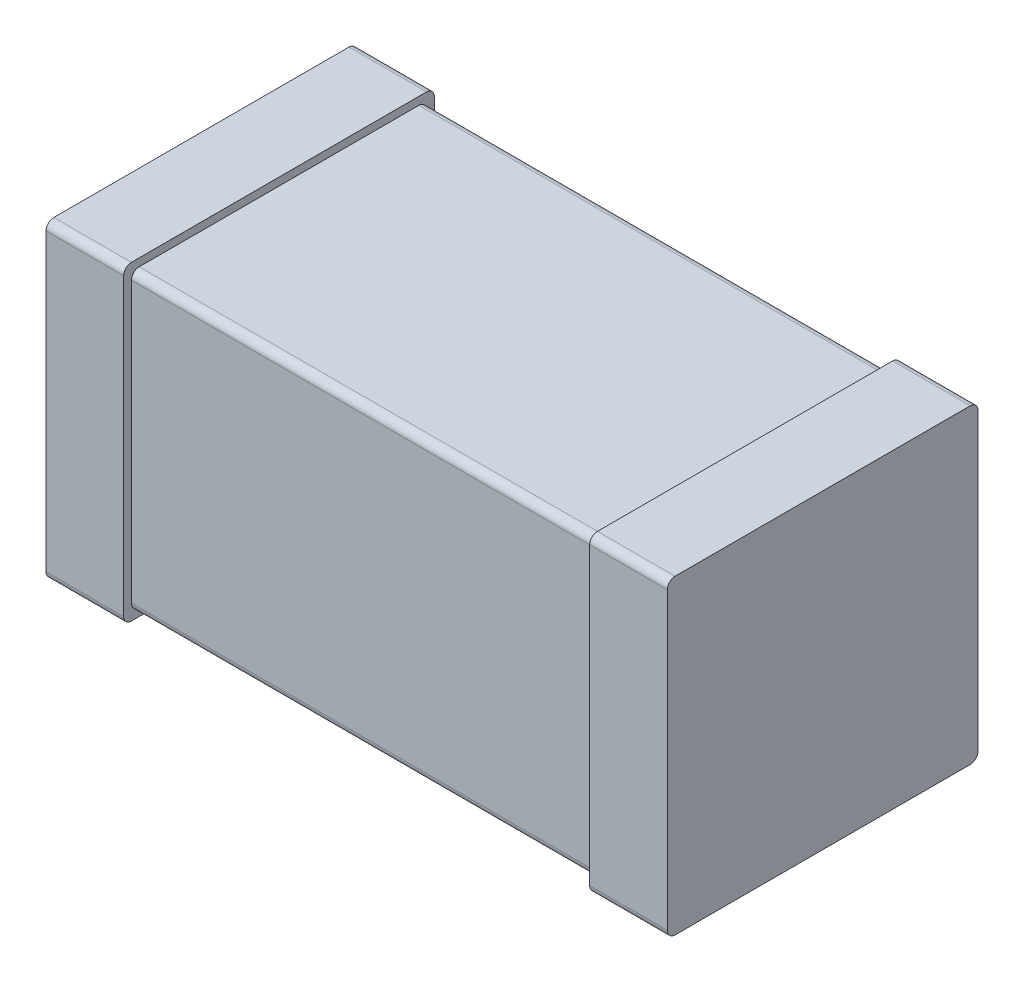
ISO-10303-21;
HEADER;
FILE_DESCRIPTION(('STEP AP214'),'2;1');
FILE_NAME('part.step','',(''),(''),'','','');
FILE_SCHEMA(('AUTOMOTIVE_DESIGN { 1 0 10303 214 1 1 1 1 }'));
ENDSEC;
DATA;
#1=APPLICATION_CONTEXT('core data for automotive mechanical design processes');
#2=APPLICATION_PROTOCOL_DEFINITION('international standard','automotive_design',2000,#1);
#3=PRODUCT_CONTEXT('',#1,'mechanical');
#4=PRODUCT('Part','Part','',(#3));
#5=PRODUCT_RELATED_PRODUCT_CATEGORY('part','',(#4));
#6=PRODUCT_DEFINITION_FORMATION('','',#4);
#7=PRODUCT_DEFINITION_CONTEXT('part definition',#1,'design');
#8=PRODUCT_DEFINITION('design','',#6,#7);
#9=PRODUCT_DEFINITION_SHAPE('','',#8);
#10=(LENGTH_UNIT() NAMED_UNIT(*) SI_UNIT(.MILLI.,.METRE.));
#11=(NAMED_UNIT(*) PLANE_ANGLE_UNIT() SI_UNIT($,.RADIAN.));
#12=(NAMED_UNIT(*) SI_UNIT($,.STERADIAN.) SOLID_ANGLE_UNIT());
#13=UNCERTAINTY_MEASURE_WITH_UNIT(LENGTH_MEASURE(1.E-05),#10,'distance_accuracy_value','');
#14=(GEOMETRIC_REPRESENTATION_CONTEXT(3) GLOBAL_UNCERTAINTY_ASSIGNED_CONTEXT((#13)) GLOBAL_UNIT_ASSIGNED_CONTEXT((#10,
#11,#12)) REPRESENTATION_CONTEXT('',''));
#15=CARTESIAN_POINT('',(0.,0.,0.));
#16=DIRECTION('',(0.,0.,1.));
#17=DIRECTION('',(1.,0.,0.));
#18=AXIS2_PLACEMENT_3D('',#15,#16,#17);
#19=CARTESIAN_POINT('',(-1.6,-0.8,0.));
#20=DIRECTION('',(1.,0.,0.));
#21=DIRECTION('',(0.,1.,0.));
#22=AXIS2_PLACEMENT_3D('',#19,#20,#21);
#23=PLANE('',#22);
#24=CARTESIAN_POINT('',(-1.6,-0.76,1.56));
#25=DIRECTION('',(-1.,0.,0.));
#26=DIRECTION('',(0.,0.,1.));
#27=AXIS2_PLACEMENT_3D('',#24,#25,#26);
#28=CIRCLE('',#27,0.04);
#29=CARTESIAN_POINT('',(-1.6,-0.8,1.56));
#30=VERTEX_POINT('',#29);
#31=CARTESIAN_POINT('',(-1.6,-0.76,1.6));
#32=VERTEX_POINT('',#31);
#33=EDGE_CURVE('E11',#30,#32,#28,.T.);
#34=ORIENTED_EDGE('',*,*,#33,.T.);
#35=DIRECTION('',(0.,1.,0.));
#36=VECTOR('',#35,1.);
#37=CARTESIAN_POINT('',(-1.6,-0.8,1.6));
#38=LINE('',#37,#36);
#39=CARTESIAN_POINT('',(-1.6,0.76,1.6));
#40=VERTEX_POINT('',#39);
#41=EDGE_CURVE('E27',#32,#40,#38,.T.);
#42=ORIENTED_EDGE('',*,*,#41,.T.);
#43=CARTESIAN_POINT('',(-1.6,0.76,1.56));
#44=DIRECTION('',(1.,0.,0.));
#45=DIRECTION('',(0.,0.,1.));
#46=AXIS2_PLACEMENT_3D('',#43,#44,#45);
#47=CIRCLE('',#46,0.04);
#48=CARTESIAN_POINT('',(-1.6,0.8,1.56));
#49=VERTEX_POINT('',#48);
#50=EDGE_CURVE('E342',#49,#40,#47,.T.);
#51=ORIENTED_EDGE('',*,*,#50,.F.);
#52=DIRECTION('',(0.,0.,1.));
#53=VECTOR('',#52,1.);
#54=CARTESIAN_POINT('',(-1.6,0.8,0.));
#55=LINE('',#54,#53);
#56=CARTESIAN_POINT('',(-1.6,0.8,0.04));
#57=VERTEX_POINT('',#56);
#58=EDGE_CURVE('E20',#57,#49,#55,.T.);
#59=ORIENTED_EDGE('',*,*,#58,.F.);
#60=CARTESIAN_POINT('',(-1.6,0.76,0.04));
#61=DIRECTION('',(-1.,0.,0.));
#62=DIRECTION('',(0.,0.,1.));
#63=AXIS2_PLACEMENT_3D('',#60,#61,#62);
#64=CIRCLE('',#63,0.04);
#65=CARTESIAN_POINT('',(-1.6,0.76,0.));
#66=VERTEX_POINT('',#65);
#67=EDGE_CURVE('E266',#57,#66,#64,.T.);
#68=ORIENTED_EDGE('',*,*,#67,.T.);
#69=DIRECTION('',(0.,1.,0.));
#70=VECTOR('',#69,1.);
#71=CARTESIAN_POINT('',(-1.6,-0.8,0.));
#72=LINE('',#71,#70);
#73=CARTESIAN_POINT('',(-1.6,-0.76,0.));
#74=VERTEX_POINT('',#73);
#75=EDGE_CURVE('E407',#74,#66,#72,.T.);
#76=ORIENTED_EDGE('',*,*,#75,.F.);
#77=CARTESIAN_POINT('',(-1.6,-0.76,0.04));
#78=DIRECTION('',(1.,0.,0.));
#79=DIRECTION('',(0.,0.,1.));
#80=AXIS2_PLACEMENT_3D('',#77,#78,#79);
#81=CIRCLE('',#80,0.04);
#82=CARTESIAN_POINT('',(-1.6,-0.8,0.04));
#83=VERTEX_POINT('',#82);
#84=EDGE_CURVE('E325',#83,#74,#81,.T.);
#85=ORIENTED_EDGE('',*,*,#84,.F.);
#86=DIRECTION('',(0.,0.,1.));
#87=VECTOR('',#86,1.);
#88=CARTESIAN_POINT('',(-1.6,-0.8,0.));
#89=LINE('',#88,#87);
#90=EDGE_CURVE('E270',#83,#30,#89,.T.);
#91=ORIENTED_EDGE('',*,*,#90,.T.);
#92=EDGE_LOOP('',(#34,#42,#51,#59,#68,#76,#85,#91));
#93=FACE_BOUND('',#92,.T.);
#94=ADVANCED_FACE('F16',(#93),#23,.F.);
#95=CARTESIAN_POINT('',(-1.6,-0.8,0.));
#96=DIRECTION('',(0.,1.,0.));
#97=DIRECTION('',(1.,0.,0.));
#98=AXIS2_PLACEMENT_3D('',#95,#96,#97);
#99=PLANE('',#98);
#100=DIRECTION('',(1.,0.,0.));
#101=VECTOR('',#100,1.);
#102=CARTESIAN_POINT('',(-1.6,-0.8,1.56));
#103=LINE('',#102,#101);
#104=CARTESIAN_POINT('',(-1.2,-0.8,1.56));
#105=VERTEX_POINT('',#104);
#106=EDGE_CURVE('E283',#30,#105,#103,.T.);
#107=ORIENTED_EDGE('',*,*,#106,.F.);
#108=ORIENTED_EDGE('',*,*,#90,.F.);
#109=DIRECTION('',(1.,0.,0.));
#110=VECTOR('',#109,1.);
#111=CARTESIAN_POINT('',(-1.6,-0.8,0.04));
#112=LINE('',#111,#110);
#113=CARTESIAN_POINT('',(-1.2,-0.8,0.04));
#114=VERTEX_POINT('',#113);
#115=EDGE_CURVE('E335',#83,#114,#112,.T.);
#116=ORIENTED_EDGE('',*,*,#115,.T.);
#117=DIRECTION('',(0.,0.,1.));
#118=VECTOR('',#117,1.);
#119=CARTESIAN_POINT('',(-1.2,-0.8,0.));
#120=LINE('',#119,#118);
#121=EDGE_CURVE('E350',#114,#105,#120,.T.);
#122=ORIENTED_EDGE('',*,*,#121,.T.);
#123=EDGE_LOOP('',(#107,#108,#116,#122));
#124=FACE_BOUND('',#123,.T.);
#125=ADVANCED_FACE('F852',(#124),#99,.F.);
#126=CARTESIAN_POINT('',(-1.6,-0.76,0.04));
#127=DIRECTION('',(1.,0.,0.));
#128=DIRECTION('',(0.,-1.,0.));
#129=AXIS2_PLACEMENT_3D('',#126,#127,#128);
#130=CYLINDRICAL_SURFACE('',#129,0.04);
#131=ORIENTED_EDGE('',*,*,#84,.T.);
#132=DIRECTION('',(1.,0.,0.));
#133=VECTOR('',#132,1.);
#134=CARTESIAN_POINT('',(-1.6,-0.76,0.));
#135=LINE('',#134,#133);
#136=CARTESIAN_POINT('',(-1.2,-0.76,0.));
#137=VERTEX_POINT('',#136);
#138=EDGE_CURVE('E286',#74,#137,#135,.T.);
#139=ORIENTED_EDGE('',*,*,#138,.T.);
#140=CARTESIAN_POINT('',(-1.2,-0.76,0.04));
#141=DIRECTION('',(1.,0.,0.));
#142=DIRECTION('',(0.,0.,1.));
#143=AXIS2_PLACEMENT_3D('',#140,#141,#142);
#144=CIRCLE('',#143,0.04);
#145=EDGE_CURVE('E375',#114,#137,#144,.T.);
#146=ORIENTED_EDGE('',*,*,#145,.F.);
#147=ORIENTED_EDGE('',*,*,#115,.F.);
#148=EDGE_LOOP('',(#131,#139,#146,#147));
#149=FACE_BOUND('',#148,.T.);
#150=ADVANCED_FACE('F844',(#149),#130,.T.);
#151=CARTESIAN_POINT('',(-1.6,-0.76,1.56));
#152=DIRECTION('',(1.,0.,0.));
#153=DIRECTION('',(0.,-1.,0.));
#154=AXIS2_PLACEMENT_3D('',#151,#152,#153);
#155=CYLINDRICAL_SURFACE('',#154,0.04);
#156=ORIENTED_EDGE('',*,*,#106,.T.);
#157=CARTESIAN_POINT('',(-1.2,-0.76,1.56));
#158=DIRECTION('',(-1.,0.,0.));
#159=DIRECTION('',(0.,0.,1.));
#160=AXIS2_PLACEMENT_3D('',#157,#158,#159);
#161=CIRCLE('',#160,0.04);
#162=CARTESIAN_POINT('',(-1.2,-0.76,1.6));
#163=VERTEX_POINT('',#162);
#164=EDGE_CURVE('E287',#105,#163,#161,.T.);
#165=ORIENTED_EDGE('',*,*,#164,.T.);
#166=DIRECTION('',(1.,0.,0.));
#167=VECTOR('',#166,1.);
#168=CARTESIAN_POINT('',(-1.6,-0.76,1.6));
#169=LINE('',#168,#167);
#170=EDGE_CURVE('E292',#32,#163,#169,.T.);
#171=ORIENTED_EDGE('',*,*,#170,.F.);
#172=ORIENTED_EDGE('',*,*,#33,.F.);
#173=EDGE_LOOP('',(#156,#165,#171,#172));
#174=FACE_BOUND('',#173,.T.);
#175=ADVANCED_FACE('F827',(#174),#155,.T.);
#176=CARTESIAN_POINT('',(-1.6,-0.8,0.));
#177=DIRECTION('',(0.,0.,1.));
#178=DIRECTION('',(1.,0.,0.));
#179=AXIS2_PLACEMENT_3D('',#176,#177,#178);
#180=PLANE('',#179);
#181=DIRECTION('',(1.,0.,0.));
#182=VECTOR('',#181,1.);
#183=CARTESIAN_POINT('',(-1.6,0.76,0.));
#184=LINE('',#183,#182);
#185=CARTESIAN_POINT('',(-1.2,0.76,0.));
#186=VERTEX_POINT('',#185);
#187=EDGE_CURVE('E386',#66,#186,#184,.T.);
#188=ORIENTED_EDGE('',*,*,#187,.T.);
#189=DIRECTION('',(0.,1.,0.));
#190=VECTOR('',#189,1.);
#191=CARTESIAN_POINT('',(-1.2,-0.8,0.));
#192=LINE('',#191,#190);
#193=EDGE_CURVE('E346',#137,#186,#192,.T.);
#194=ORIENTED_EDGE('',*,*,#193,.F.);
#195=ORIENTED_EDGE('',*,*,#138,.F.);
#196=ORIENTED_EDGE('',*,*,#75,.T.);
#197=EDGE_LOOP('',(#188,#194,#195,#196));
#198=FACE_BOUND('',#197,.T.);
#199=ADVANCED_FACE('F807',(#198),#180,.F.);
#200=CARTESIAN_POINT('',(-1.6,-0.8,1.6));
#201=DIRECTION('',(0.,0.,1.));
#202=DIRECTION('',(1.,0.,0.));
#203=AXIS2_PLACEMENT_3D('',#200,#201,#202);
#204=PLANE('',#203);
#205=ORIENTED_EDGE('',*,*,#41,.F.);
#206=ORIENTED_EDGE('',*,*,#170,.T.);
#207=DIRECTION('',(0.,1.,0.));
#208=VECTOR('',#207,1.);
#209=CARTESIAN_POINT('',(-1.2,-0.8,1.6));
#210=LINE('',#209,#208);
#211=CARTESIAN_POINT('',(-1.2,0.76,1.6));
#212=VERTEX_POINT('',#211);
#213=EDGE_CURVE('E288',#163,#212,#210,.T.);
#214=ORIENTED_EDGE('',*,*,#213,.T.);
#215=DIRECTION('',(1.,0.,0.));
#216=VECTOR('',#215,1.);
#217=CARTESIAN_POINT('',(-1.6,0.76,1.6));
#218=LINE('',#217,#216);
#219=EDGE_CURVE('E339',#40,#212,#218,.T.);
#220=ORIENTED_EDGE('',*,*,#219,.F.);
#221=EDGE_LOOP('',(#205,#206,#214,#220));
#222=FACE_BOUND('',#221,.T.);
#223=ADVANCED_FACE('F802',(#222),#204,.T.);
#224=CARTESIAN_POINT('',(-1.6,0.76,0.04));
#225=DIRECTION('',(1.,0.,0.));
#226=DIRECTION('',(0.,1.,0.));
#227=AXIS2_PLACEMENT_3D('',#224,#225,#226);
#228=CYLINDRICAL_SURFACE('',#227,0.04);
#229=DIRECTION('',(1.,0.,0.));
#230=VECTOR('',#229,1.);
#231=CARTESIAN_POINT('',(-1.6,0.8,0.04));
#232=LINE('',#231,#230);
#233=CARTESIAN_POINT('',(-1.2,0.8,0.04));
#234=VERTEX_POINT('',#233);
#235=EDGE_CURVE('E293',#57,#234,#232,.T.);
#236=ORIENTED_EDGE('',*,*,#235,.T.);
#237=CARTESIAN_POINT('',(-1.2,0.76,0.04));
#238=DIRECTION('',(-1.,0.,0.));
#239=DIRECTION('',(0.,0.,1.));
#240=AXIS2_PLACEMENT_3D('',#237,#238,#239);
#241=CIRCLE('',#240,0.04);
#242=EDGE_CURVE('E451',#234,#186,#241,.T.);
#243=ORIENTED_EDGE('',*,*,#242,.T.);
#244=ORIENTED_EDGE('',*,*,#187,.F.);
#245=ORIENTED_EDGE('',*,*,#67,.F.);
#246=EDGE_LOOP('',(#236,#243,#244,#245));
#247=FACE_BOUND('',#246,.T.);
#248=ADVANCED_FACE('F806',(#247),#228,.T.);
#249=CARTESIAN_POINT('',(-1.6,0.76,1.56));
#250=DIRECTION('',(1.,0.,0.));
#251=DIRECTION('',(0.,1.,0.));
#252=AXIS2_PLACEMENT_3D('',#249,#250,#251);
#253=CYLINDRICAL_SURFACE('',#252,0.04);
#254=ORIENTED_EDGE('',*,*,#50,.T.);
#255=ORIENTED_EDGE('',*,*,#219,.T.);
#256=CARTESIAN_POINT('',(-1.2,0.76,1.56));
#257=DIRECTION('',(1.,0.,0.));
#258=DIRECTION('',(0.,0.,1.));
#259=AXIS2_PLACEMENT_3D('',#256,#257,#258);
#260=CIRCLE('',#259,0.04);
#261=CARTESIAN_POINT('',(-1.2,0.8,1.56));
#262=VERTEX_POINT('',#261);
#263=EDGE_CURVE('E294',#262,#212,#260,.T.);
#264=ORIENTED_EDGE('',*,*,#263,.F.);
#265=DIRECTION('',(1.,0.,0.));
#266=VECTOR('',#265,1.);
#267=CARTESIAN_POINT('',(-1.6,0.8,1.56));
#268=LINE('',#267,#266);
#269=EDGE_CURVE('E395',#49,#262,#268,.T.);
#270=ORIENTED_EDGE('',*,*,#269,.F.);
#271=EDGE_LOOP('',(#254,#255,#264,#270));
#272=FACE_BOUND('',#271,.T.);
#273=ADVANCED_FACE('F815',(#272),#253,.T.);
#274=CARTESIAN_POINT('',(-1.6,0.8,0.));
#275=DIRECTION('',(0.,1.,0.));
#276=DIRECTION('',(1.,0.,0.));
#277=AXIS2_PLACEMENT_3D('',#274,#275,#276);
#278=PLANE('',#277);
#279=DIRECTION('',(0.,0.,1.));
#280=VECTOR('',#279,1.);
#281=CARTESIAN_POINT('',(-1.2,0.8,0.));
#282=LINE('',#281,#280);
#283=EDGE_CURVE('E298',#234,#262,#282,.T.);
#284=ORIENTED_EDGE('',*,*,#283,.F.);
#285=ORIENTED_EDGE('',*,*,#235,.F.);
#286=ORIENTED_EDGE('',*,*,#58,.T.);
#287=ORIENTED_EDGE('',*,*,#269,.T.);
#288=EDGE_LOOP('',(#284,#285,#286,#287));
#289=FACE_BOUND('',#288,.T.);
#290=ADVANCED_FACE('F794',(#289),#278,.T.);
#291=CARTESIAN_POINT('',(-1.2,-0.8,0.));
#292=DIRECTION('',(1.,0.,0.));
#293=DIRECTION('',(0.,1.,0.));
#294=AXIS2_PLACEMENT_3D('',#291,#292,#293);
#295=PLANE('',#294);
#296=ORIENTED_EDGE('',*,*,#121,.F.);
#297=ORIENTED_EDGE('',*,*,#145,.T.);
#298=ORIENTED_EDGE('',*,*,#193,.T.);
#299=ORIENTED_EDGE('',*,*,#242,.F.);
#300=ORIENTED_EDGE('',*,*,#283,.T.);
#301=ORIENTED_EDGE('',*,*,#263,.T.);
#302=ORIENTED_EDGE('',*,*,#213,.F.);
#303=ORIENTED_EDGE('',*,*,#164,.F.);
#304=EDGE_LOOP('',(#296,#297,#298,#299,#300,#301,#302,#303));
#305=FACE_BOUND('',#304,.T.);
#306=CARTESIAN_POINT('',(-1.2,-0.72,0.08));
#307=DIRECTION('',(1.,0.,0.));
#308=DIRECTION('',(0.,0.,1.));
#309=AXIS2_PLACEMENT_3D('',#306,#307,#308);
#310=CIRCLE('',#309,0.04);
#311=CARTESIAN_POINT('',(-1.2,-0.76,0.08));
#312=VERTEX_POINT('',#311);
#313=CARTESIAN_POINT('',(-1.2,-0.72,0.04));
#314=VERTEX_POINT('',#313);
#315=EDGE_CURVE('E363',#312,#314,#310,.T.);
#316=ORIENTED_EDGE('',*,*,#315,.F.);
#317=DIRECTION('',(0.,0.,1.));
#318=VECTOR('',#317,1.);
#319=CARTESIAN_POINT('',(-1.2,-0.76,0.04));
#320=LINE('',#319,#318);
#321=CARTESIAN_POINT('',(-1.2,-0.76,1.52));
#322=VERTEX_POINT('',#321);
#323=EDGE_CURVE('E299',#312,#322,#320,.T.);
#324=ORIENTED_EDGE('',*,*,#323,.T.);
#325=CARTESIAN_POINT('',(-1.2,-0.72,1.52));
#326=DIRECTION('',(-1.,0.,0.));
#327=DIRECTION('',(0.,0.,1.));
#328=AXIS2_PLACEMENT_3D('',#325,#326,#327);
#329=CIRCLE('',#328,0.04);
#330=CARTESIAN_POINT('',(-1.2,-0.72,1.56));
#331=VERTEX_POINT('',#330);
#332=EDGE_CURVE('E413',#322,#331,#329,.T.);
#333=ORIENTED_EDGE('',*,*,#332,.T.);
#334=DIRECTION('',(0.,1.,0.));
#335=VECTOR('',#334,1.);
#336=CARTESIAN_POINT('',(-1.2,-0.76,1.56));
#337=LINE('',#336,#335);
#338=CARTESIAN_POINT('',(-1.2,0.72,1.56));
#339=VERTEX_POINT('',#338);
#340=EDGE_CURVE('E372',#331,#339,#337,.T.);
#341=ORIENTED_EDGE('',*,*,#340,.T.);
#342=CARTESIAN_POINT('',(-1.2,0.72,1.52));
#343=DIRECTION('',(1.,0.,0.));
#344=DIRECTION('',(0.,0.,1.));
#345=AXIS2_PLACEMENT_3D('',#342,#343,#344);
#346=CIRCLE('',#345,0.04);
#347=CARTESIAN_POINT('',(-1.2,0.76,1.52));
#348=VERTEX_POINT('',#347);
#349=EDGE_CURVE('E264',#348,#339,#346,.T.);
#350=ORIENTED_EDGE('',*,*,#349,.F.);
#351=DIRECTION('',(0.,0.,1.));
#352=VECTOR('',#351,1.);
#353=CARTESIAN_POINT('',(-1.2,0.76,0.04));
#354=LINE('',#353,#352);
#355=CARTESIAN_POINT('',(-1.2,0.76,0.08));
#356=VERTEX_POINT('',#355);
#357=EDGE_CURVE('E263',#356,#348,#354,.T.);
#358=ORIENTED_EDGE('',*,*,#357,.F.);
#359=CARTESIAN_POINT('',(-1.2,0.72,0.08));
#360=DIRECTION('',(-1.,0.,0.));
#361=DIRECTION('',(0.,0.,1.));
#362=AXIS2_PLACEMENT_3D('',#359,#360,#361);
#363=CIRCLE('',#362,0.04);
#364=CARTESIAN_POINT('',(-1.2,0.72,0.04));
#365=VERTEX_POINT('',#364);
#366=EDGE_CURVE('E367',#356,#365,#363,.T.);
#367=ORIENTED_EDGE('',*,*,#366,.T.);
#368=DIRECTION('',(0.,1.,0.));
#369=VECTOR('',#368,1.);
#370=CARTESIAN_POINT('',(-1.2,-0.76,0.04));
#371=LINE('',#370,#369);
#372=EDGE_CURVE('E356',#314,#365,#371,.T.);
#373=ORIENTED_EDGE('',*,*,#372,.F.);
#374=EDGE_LOOP('',(#316,#324,#333,#341,#350,#358,#367,#373));
#375=FACE_BOUND('',#374,.T.);
#376=ADVANCED_FACE('F529',(#305,#375),#295,.T.);
#377=CARTESIAN_POINT('',(-1.2,-0.72,0.08));
#378=DIRECTION('',(1.,0.,0.));
#379=DIRECTION('',(0.,-1.,0.));
#380=AXIS2_PLACEMENT_3D('',#377,#378,#379);
#381=CYLINDRICAL_SURFACE('',#380,0.04);
#382=ORIENTED_EDGE('',*,*,#315,.T.);
#383=DIRECTION('',(1.,0.,0.));
#384=VECTOR('',#383,1.);
#385=CARTESIAN_POINT('',(-1.2,-0.72,0.04));
#386=LINE('',#385,#384);
#387=CARTESIAN_POINT('',(1.2,-0.72,0.04));
#388=VERTEX_POINT('',#387);
#389=EDGE_CURVE('E368',#314,#388,#386,.T.);
#390=ORIENTED_EDGE('',*,*,#389,.T.);
#391=CARTESIAN_POINT('',(1.2,-0.72,0.08));
#392=DIRECTION('',(1.,0.,0.));
#393=DIRECTION('',(0.,0.,1.));
#394=AXIS2_PLACEMENT_3D('',#391,#392,#393);
#395=CIRCLE('',#394,0.04);
#396=CARTESIAN_POINT('',(1.2,-0.76,0.08));
#397=VERTEX_POINT('',#396);
#398=EDGE_CURVE('E160',#397,#388,#395,.T.);
#399=ORIENTED_EDGE('',*,*,#398,.F.);
#400=DIRECTION('',(1.,0.,0.));
#401=VECTOR('',#400,1.);
#402=CARTESIAN_POINT('',(-1.2,-0.76,0.08));
#403=LINE('',#402,#401);
#404=EDGE_CURVE('E314',#312,#397,#403,.T.);
#405=ORIENTED_EDGE('',*,*,#404,.F.);
#406=EDGE_LOOP('',(#382,#390,#399,#405));
#407=FACE_BOUND('',#406,.T.);
#408=ADVANCED_FACE('F533',(#407),#381,.T.);
#409=CARTESIAN_POINT('',(-1.2,-0.76,0.04));
#410=DIRECTION('',(0.,0.,1.));
#411=DIRECTION('',(1.,0.,0.));
#412=AXIS2_PLACEMENT_3D('',#409,#410,#411);
#413=PLANE('',#412);
#414=DIRECTION('',(1.,0.,0.));
#415=VECTOR('',#414,1.);
#416=CARTESIAN_POINT('',(-1.2,0.72,0.04));
#417=LINE('',#416,#415);
#418=CARTESIAN_POINT('',(1.2,0.72,0.04));
#419=VERTEX_POINT('',#418);
#420=EDGE_CURVE('E359',#365,#419,#417,.T.);
#421=ORIENTED_EDGE('',*,*,#420,.T.);
#422=DIRECTION('',(0.,1.,0.));
#423=VECTOR('',#422,1.);
#424=CARTESIAN_POINT('',(1.2,-0.76,0.04));
#425=LINE('',#424,#423);
#426=EDGE_CURVE('E172',#388,#419,#425,.T.);
#427=ORIENTED_EDGE('',*,*,#426,.F.);
#428=ORIENTED_EDGE('',*,*,#389,.F.);
#429=ORIENTED_EDGE('',*,*,#372,.T.);
#430=EDGE_LOOP('',(#421,#427,#428,#429));
#431=FACE_BOUND('',#430,.T.);
#432=ADVANCED_FACE('F536',(#431),#413,.F.);
#433=CARTESIAN_POINT('',(-1.2,0.72,0.08));
#434=DIRECTION('',(1.,0.,0.));
#435=DIRECTION('',(0.,1.,0.));
#436=AXIS2_PLACEMENT_3D('',#433,#434,#435);
#437=CYLINDRICAL_SURFACE('',#436,0.04);
#438=DIRECTION('',(1.,0.,0.));
#439=VECTOR('',#438,1.);
#440=CARTESIAN_POINT('',(-1.2,0.76,0.08));
#441=LINE('',#440,#439);
#442=CARTESIAN_POINT('',(1.2,0.76,0.08));
#443=VERTEX_POINT('',#442);
#444=EDGE_CURVE('E355',#356,#443,#441,.T.);
#445=ORIENTED_EDGE('',*,*,#444,.T.);
#446=CARTESIAN_POINT('',(1.2,0.72,0.08));
#447=DIRECTION('',(-1.,0.,0.));
#448=DIRECTION('',(0.,0.,1.));
#449=AXIS2_PLACEMENT_3D('',#446,#447,#448);
#450=CIRCLE('',#449,0.04);
#451=EDGE_CURVE('E351',#443,#419,#450,.T.);
#452=ORIENTED_EDGE('',*,*,#451,.T.);
#453=ORIENTED_EDGE('',*,*,#420,.F.);
#454=ORIENTED_EDGE('',*,*,#366,.F.);
#455=EDGE_LOOP('',(#445,#452,#453,#454));
#456=FACE_BOUND('',#455,.T.);
#457=ADVANCED_FACE('F540',(#456),#437,.T.);
#458=CARTESIAN_POINT('',(-1.2,0.76,0.04));
#459=DIRECTION('',(0.,1.,0.));
#460=DIRECTION('',(1.,0.,0.));
#461=AXIS2_PLACEMENT_3D('',#458,#459,#460);
#462=PLANE('',#461);
#463=DIRECTION('',(0.,0.,1.));
#464=VECTOR('',#463,1.);
#465=CARTESIAN_POINT('',(1.2,0.76,0.04));
#466=LINE('',#465,#464);
#467=CARTESIAN_POINT('',(1.2,0.76,1.52));
#468=VERTEX_POINT('',#467);
#469=EDGE_CURVE('E328',#443,#468,#466,.T.);
#470=ORIENTED_EDGE('',*,*,#469,.F.);
#471=ORIENTED_EDGE('',*,*,#444,.F.);
#472=ORIENTED_EDGE('',*,*,#357,.T.);
#473=DIRECTION('',(1.,0.,0.));
#474=VECTOR('',#473,1.);
#475=CARTESIAN_POINT('',(-1.2,0.76,1.52));
#476=LINE('',#475,#474);
#477=EDGE_CURVE('E261',#348,#468,#476,.T.);
#478=ORIENTED_EDGE('',*,*,#477,.T.);
#479=EDGE_LOOP('',(#470,#471,#472,#478));
#480=FACE_BOUND('',#479,.T.);
#481=ADVANCED_FACE('F543',(#480),#462,.T.);
#482=CARTESIAN_POINT('',(-1.2,0.72,1.52));
#483=DIRECTION('',(1.,0.,0.));
#484=DIRECTION('',(0.,1.,0.));
#485=AXIS2_PLACEMENT_3D('',#482,#483,#484);
#486=CYLINDRICAL_SURFACE('',#485,0.04);
#487=ORIENTED_EDGE('',*,*,#349,.T.);
#488=DIRECTION('',(1.,0.,0.));
#489=VECTOR('',#488,1.);
#490=CARTESIAN_POINT('',(-1.2,0.72,1.56));
#491=LINE('',#490,#489);
#492=CARTESIAN_POINT('',(1.2,0.72,1.56));
#493=VERTEX_POINT('',#492);
#494=EDGE_CURVE('E444',#339,#493,#491,.T.);
#495=ORIENTED_EDGE('',*,*,#494,.T.);
#496=CARTESIAN_POINT('',(1.2,0.72,1.52));
#497=DIRECTION('',(1.,0.,0.));
#498=DIRECTION('',(0.,0.,1.));
#499=AXIS2_PLACEMENT_3D('',#496,#497,#498);
#500=CIRCLE('',#499,0.04);
#501=EDGE_CURVE('E320',#468,#493,#500,.T.);
#502=ORIENTED_EDGE('',*,*,#501,.F.);
#503=ORIENTED_EDGE('',*,*,#477,.F.);
#504=EDGE_LOOP('',(#487,#495,#502,#503));
#505=FACE_BOUND('',#504,.T.);
#506=ADVANCED_FACE('F18',(#505),#486,.T.);
#507=CARTESIAN_POINT('',(-1.2,-0.76,1.56));
#508=DIRECTION('',(0.,0.,1.));
#509=DIRECTION('',(1.,0.,0.));
#510=AXIS2_PLACEMENT_3D('',#507,#508,#509);
#511=PLANE('',#510);
#512=ORIENTED_EDGE('',*,*,#340,.F.);
#513=DIRECTION('',(1.,0.,0.));
#514=VECTOR('',#513,1.);
#515=CARTESIAN_POINT('',(-1.2,-0.72,1.56));
#516=LINE('',#515,#514);
#517=CARTESIAN_POINT('',(1.2,-0.72,1.56));
#518=VERTEX_POINT('',#517);
#519=EDGE_CURVE('E432',#331,#518,#516,.T.);
#520=ORIENTED_EDGE('',*,*,#519,.T.);
#521=DIRECTION('',(0.,1.,0.));
#522=VECTOR('',#521,1.);
#523=CARTESIAN_POINT('',(1.2,-0.76,1.56));
#524=LINE('',#523,#522);
#525=EDGE_CURVE('E274',#518,#493,#524,.T.);
#526=ORIENTED_EDGE('',*,*,#525,.T.);
#527=ORIENTED_EDGE('',*,*,#494,.F.);
#528=EDGE_LOOP('',(#512,#520,#526,#527));
#529=FACE_BOUND('',#528,.T.);
#530=ADVANCED_FACE('F517',(#529),#511,.T.);
#531=CARTESIAN_POINT('',(-1.2,-0.72,1.52));
#532=DIRECTION('',(1.,0.,0.));
#533=DIRECTION('',(0.,-1.,0.));
#534=AXIS2_PLACEMENT_3D('',#531,#532,#533);
#535=CYLINDRICAL_SURFACE('',#534,0.04);
#536=DIRECTION('',(1.,0.,0.));
#537=VECTOR('',#536,1.);
#538=CARTESIAN_POINT('',(-1.2,-0.76,1.52));
#539=LINE('',#538,#537);
#540=CARTESIAN_POINT('',(1.2,-0.76,1.52));
#541=VERTEX_POINT('',#540);
#542=EDGE_CURVE('E271',#322,#541,#539,.T.);
#543=ORIENTED_EDGE('',*,*,#542,.T.);
#544=CARTESIAN_POINT('',(1.2,-0.72,1.52));
#545=DIRECTION('',(-1.,0.,0.));
#546=DIRECTION('',(0.,0.,1.));
#547=AXIS2_PLACEMENT_3D('',#544,#545,#546);
#548=CIRCLE('',#547,0.04);
#549=EDGE_CURVE('E275',#541,#518,#548,.T.);
#550=ORIENTED_EDGE('',*,*,#549,.T.);
#551=ORIENTED_EDGE('',*,*,#519,.F.);
#552=ORIENTED_EDGE('',*,*,#332,.F.);
#553=EDGE_LOOP('',(#543,#550,#551,#552));
#554=FACE_BOUND('',#553,.T.);
#555=ADVANCED_FACE('F520',(#554),#535,.T.);
#556=CARTESIAN_POINT('',(-1.2,-0.76,0.04));
#557=DIRECTION('',(0.,1.,0.));
#558=DIRECTION('',(1.,0.,0.));
#559=AXIS2_PLACEMENT_3D('',#556,#557,#558);
#560=PLANE('',#559);
#561=ORIENTED_EDGE('',*,*,#542,.F.);
#562=ORIENTED_EDGE('',*,*,#323,.F.);
#563=ORIENTED_EDGE('',*,*,#404,.T.);
#564=DIRECTION('',(0.,0.,1.));
#565=VECTOR('',#564,1.);
#566=CARTESIAN_POINT('',(1.2,-0.76,0.04));
#567=LINE('',#566,#565);
#568=EDGE_CURVE('E317',#397,#541,#567,.T.);
#569=ORIENTED_EDGE('',*,*,#568,.T.);
#570=EDGE_LOOP('',(#561,#562,#563,#569));
#571=FACE_BOUND('',#570,.T.);
#572=ADVANCED_FACE('F532',(#571),#560,.F.);
#573=CARTESIAN_POINT('',(1.2,-0.8,0.));
#574=DIRECTION('',(1.,0.,0.));
#575=DIRECTION('',(0.,1.,0.));
#576=AXIS2_PLACEMENT_3D('',#573,#574,#575);
#577=PLANE('',#576);
#578=CARTESIAN_POINT('',(1.2,-0.76,1.56));
#579=DIRECTION('',(-1.,0.,0.));
#580=DIRECTION('',(0.,0.,1.));
#581=AXIS2_PLACEMENT_3D('',#578,#579,#580);
#582=CIRCLE('',#581,0.04);
#583=CARTESIAN_POINT('',(1.2,-0.8,1.56));
#584=VERTEX_POINT('',#583);
#585=CARTESIAN_POINT('',(1.2,-0.76,1.6));
#586=VERTEX_POINT('',#585);
#587=EDGE_CURVE('E238',#584,#586,#582,.T.);
#588=ORIENTED_EDGE('',*,*,#587,.T.);
#589=DIRECTION('',(0.,1.,0.));
#590=VECTOR('',#589,1.);
#591=CARTESIAN_POINT('',(1.2,-0.8,1.6));
#592=LINE('',#591,#590);
#593=CARTESIAN_POINT('',(1.2,0.76,1.6));
#594=VERTEX_POINT('',#593);
#595=EDGE_CURVE('E234',#586,#594,#592,.T.);
#596=ORIENTED_EDGE('',*,*,#595,.T.);
#597=CARTESIAN_POINT('',(1.2,0.76,1.56));
#598=DIRECTION('',(1.,0.,0.));
#599=DIRECTION('',(0.,0.,1.));
#600=AXIS2_PLACEMENT_3D('',#597,#598,#599);
#601=CIRCLE('',#600,0.04);
#602=CARTESIAN_POINT('',(1.2,0.8,1.56));
#603=VERTEX_POINT('',#602);
#604=EDGE_CURVE('E221',#603,#594,#601,.T.);
#605=ORIENTED_EDGE('',*,*,#604,.F.);
#606=DIRECTION('',(0.,0.,1.));
#607=VECTOR('',#606,1.);
#608=CARTESIAN_POINT('',(1.2,0.8,0.));
#609=LINE('',#608,#607);
#610=CARTESIAN_POINT('',(1.2,0.8,0.04));
#611=VERTEX_POINT('',#610);
#612=EDGE_CURVE('E250',#611,#603,#609,.T.);
#613=ORIENTED_EDGE('',*,*,#612,.F.);
#614=CARTESIAN_POINT('',(1.2,0.76,0.04));
#615=DIRECTION('',(-1.,0.,0.));
#616=DIRECTION('',(0.,0.,1.));
#617=AXIS2_PLACEMENT_3D('',#614,#615,#616);
#618=CIRCLE('',#617,0.04);
#619=CARTESIAN_POINT('',(1.2,0.76,0.));
#620=VERTEX_POINT('',#619);
#621=EDGE_CURVE('E243',#611,#620,#618,.T.);
#622=ORIENTED_EDGE('',*,*,#621,.T.);
#623=DIRECTION('',(0.,1.,0.));
#624=VECTOR('',#623,1.);
#625=CARTESIAN_POINT('',(1.2,-0.8,0.));
#626=LINE('',#625,#624);
#627=CARTESIAN_POINT('',(1.2,-0.76,0.));
#628=VERTEX_POINT('',#627);
#629=EDGE_CURVE('E282',#628,#620,#626,.T.);
#630=ORIENTED_EDGE('',*,*,#629,.F.);
#631=CARTESIAN_POINT('',(1.2,-0.76,0.04));
#632=DIRECTION('',(1.,0.,0.));
#633=DIRECTION('',(0.,0.,1.));
#634=AXIS2_PLACEMENT_3D('',#631,#632,#633);
#635=CIRCLE('',#634,0.04);
#636=CARTESIAN_POINT('',(1.2,-0.8,0.04));
#637=VERTEX_POINT('',#636);
#638=EDGE_CURVE('E259',#637,#628,#635,.T.);
#639=ORIENTED_EDGE('',*,*,#638,.F.);
#640=DIRECTION('',(0.,0.,1.));
#641=VECTOR('',#640,1.);
#642=CARTESIAN_POINT('',(1.2,-0.8,0.));
#643=LINE('',#642,#641);
#644=EDGE_CURVE('E338',#637,#584,#643,.T.);
#645=ORIENTED_EDGE('',*,*,#644,.T.);
#646=EDGE_LOOP('',(#588,#596,#605,#613,#622,#630,#639,#645));
#647=FACE_BOUND('',#646,.T.);
#648=ORIENTED_EDGE('',*,*,#426,.T.);
#649=ORIENTED_EDGE('',*,*,#451,.F.);
#650=ORIENTED_EDGE('',*,*,#469,.T.);
#651=ORIENTED_EDGE('',*,*,#501,.T.);
#652=ORIENTED_EDGE('',*,*,#525,.F.);
#653=ORIENTED_EDGE('',*,*,#549,.F.);
#654=ORIENTED_EDGE('',*,*,#568,.F.);
#655=ORIENTED_EDGE('',*,*,#398,.T.);
#656=EDGE_LOOP('',(#648,#649,#650,#651,#652,#653,#654,#655));
#657=FACE_BOUND('',#656,.T.);
#658=ADVANCED_FACE('F235',(#647,#657),#577,.F.);
#659=CARTESIAN_POINT('',(1.2,-0.8,0.));
#660=DIRECTION('',(0.,1.,0.));
#661=DIRECTION('',(1.,0.,0.));
#662=AXIS2_PLACEMENT_3D('',#659,#660,#661);
#663=PLANE('',#662);
#664=DIRECTION('',(1.,0.,0.));
#665=VECTOR('',#664,1.);
#666=CARTESIAN_POINT('',(1.2,-0.8,1.56));
#667=LINE('',#666,#665);
#668=CARTESIAN_POINT('',(1.6,-0.8,1.56));
#669=VERTEX_POINT('',#668);
#670=EDGE_CURVE('E300',#584,#669,#667,.T.);
#671=ORIENTED_EDGE('',*,*,#670,.F.);
#672=ORIENTED_EDGE('',*,*,#644,.F.);
#673=DIRECTION('',(1.,0.,0.));
#674=VECTOR('',#673,1.);
#675=CARTESIAN_POINT('',(1.2,-0.8,0.04));
#676=LINE('',#675,#674);
#677=CARTESIAN_POINT('',(1.6,-0.8,0.04));
#678=VERTEX_POINT('',#677);
#679=EDGE_CURVE('E321',#637,#678,#676,.T.);
#680=ORIENTED_EDGE('',*,*,#679,.T.);
#681=DIRECTION('',(0.,0.,1.));
#682=VECTOR('',#681,1.);
#683=CARTESIAN_POINT('',(1.6,-0.8,0.));
#684=LINE('',#683,#682);
#685=EDGE_CURVE('E376',#678,#669,#684,.T.);
#686=ORIENTED_EDGE('',*,*,#685,.T.);
#687=EDGE_LOOP('',(#671,#672,#680,#686));
#688=FACE_BOUND('',#687,.T.);
#689=ADVANCED_FACE('F702',(#688),#663,.F.);
#690=CARTESIAN_POINT('',(1.2,-0.76,0.04));
#691=DIRECTION('',(1.,0.,0.));
#692=DIRECTION('',(0.,-1.,0.));
#693=AXIS2_PLACEMENT_3D('',#690,#691,#692);
#694=CYLINDRICAL_SURFACE('',#693,0.04);
#695=ORIENTED_EDGE('',*,*,#638,.T.);
#696=DIRECTION('',(1.,0.,0.));
#697=VECTOR('',#696,1.);
#698=CARTESIAN_POINT('',(1.2,-0.76,0.));
#699=LINE('',#698,#697);
#700=CARTESIAN_POINT('',(1.6,-0.76,0.));
#701=VERTEX_POINT('',#700);
#702=EDGE_CURVE('E303',#628,#701,#699,.T.);
#703=ORIENTED_EDGE('',*,*,#702,.T.);
#704=CARTESIAN_POINT('',(1.6,-0.76,0.04));
#705=DIRECTION('',(1.,0.,0.));
#706=DIRECTION('',(0.,0.,1.));
#707=AXIS2_PLACEMENT_3D('',#704,#705,#706);
#708=CIRCLE('',#707,0.04);
#709=EDGE_CURVE('E389',#678,#701,#708,.T.);
#710=ORIENTED_EDGE('',*,*,#709,.F.);
#711=ORIENTED_EDGE('',*,*,#679,.F.);
#712=EDGE_LOOP('',(#695,#703,#710,#711));
#713=FACE_BOUND('',#712,.T.);
#714=ADVANCED_FACE('F497',(#713),#694,.T.);
#715=CARTESIAN_POINT('',(1.2,-0.76,1.56));
#716=DIRECTION('',(1.,0.,0.));
#717=DIRECTION('',(0.,-1.,0.));
#718=AXIS2_PLACEMENT_3D('',#715,#716,#717);
#719=CYLINDRICAL_SURFACE('',#718,0.04);
#720=ORIENTED_EDGE('',*,*,#670,.T.);
#721=CARTESIAN_POINT('',(1.6,-0.76,1.56));
#722=DIRECTION('',(-1.,0.,0.));
#723=DIRECTION('',(0.,0.,1.));
#724=AXIS2_PLACEMENT_3D('',#721,#722,#723);
#725=CIRCLE('',#724,0.04);
#726=CARTESIAN_POINT('',(1.6,-0.76,1.6));
#727=VERTEX_POINT('',#726);
#728=EDGE_CURVE('E304',#669,#727,#725,.T.);
#729=ORIENTED_EDGE('',*,*,#728,.T.);
#730=DIRECTION('',(1.,0.,0.));
#731=VECTOR('',#730,1.);
#732=CARTESIAN_POINT('',(1.2,-0.76,1.6));
#733=LINE('',#732,#731);
#734=EDGE_CURVE('E279',#586,#727,#733,.T.);
#735=ORIENTED_EDGE('',*,*,#734,.F.);
#736=ORIENTED_EDGE('',*,*,#587,.F.);
#737=EDGE_LOOP('',(#720,#729,#735,#736));
#738=FACE_BOUND('',#737,.T.);
#739=ADVANCED_FACE('F555',(#738),#719,.T.);
#740=CARTESIAN_POINT('',(1.2,-0.8,0.));
#741=DIRECTION('',(0.,0.,1.));
#742=DIRECTION('',(1.,0.,0.));
#743=AXIS2_PLACEMENT_3D('',#740,#741,#742);
#744=PLANE('',#743);
#745=DIRECTION('',(1.,0.,0.));
#746=VECTOR('',#745,1.);
#747=CARTESIAN_POINT('',(1.2,0.76,0.));
#748=LINE('',#747,#746);
#749=CARTESIAN_POINT('',(1.6,0.76,0.));
#750=VERTEX_POINT('',#749);
#751=EDGE_CURVE('E329',#620,#750,#748,.T.);
#752=ORIENTED_EDGE('',*,*,#751,.T.);
#753=DIRECTION('',(0.,1.,0.));
#754=VECTOR('',#753,1.);
#755=CARTESIAN_POINT('',(1.6,-0.8,0.));
#756=LINE('',#755,#754);
#757=EDGE_CURVE('E309',#701,#750,#756,.T.);
#758=ORIENTED_EDGE('',*,*,#757,.F.);
#759=ORIENTED_EDGE('',*,*,#702,.F.);
#760=ORIENTED_EDGE('',*,*,#629,.T.);
#761=EDGE_LOOP('',(#752,#758,#759,#760));
#762=FACE_BOUND('',#761,.T.);
#763=ADVANCED_FACE('F499',(#762),#744,.F.);
#764=CARTESIAN_POINT('',(1.2,-0.8,1.6));
#765=DIRECTION('',(0.,0.,1.));
#766=DIRECTION('',(1.,0.,0.));
#767=AXIS2_PLACEMENT_3D('',#764,#765,#766);
#768=PLANE('',#767);
#769=ORIENTED_EDGE('',*,*,#595,.F.);
#770=ORIENTED_EDGE('',*,*,#734,.T.);
#771=DIRECTION('',(0.,1.,0.));
#772=VECTOR('',#771,1.);
#773=CARTESIAN_POINT('',(1.6,-0.8,1.6));
#774=LINE('',#773,#772);
#775=CARTESIAN_POINT('',(1.6,0.76,1.6));
#776=VERTEX_POINT('',#775);
#777=EDGE_CURVE('E247',#727,#776,#774,.T.);
#778=ORIENTED_EDGE('',*,*,#777,.T.);
#779=DIRECTION('',(1.,0.,0.));
#780=VECTOR('',#779,1.);
#781=CARTESIAN_POINT('',(1.2,0.76,1.6));
#782=LINE('',#781,#780);
#783=EDGE_CURVE('E225',#594,#776,#782,.T.);
#784=ORIENTED_EDGE('',*,*,#783,.F.);
#785=EDGE_LOOP('',(#769,#770,#778,#784));
#786=FACE_BOUND('',#785,.T.);
#787=ADVANCED_FACE('F245',(#786),#768,.T.);
#788=CARTESIAN_POINT('',(1.2,0.76,0.04));
#789=DIRECTION('',(1.,0.,0.));
#790=DIRECTION('',(0.,1.,0.));
#791=AXIS2_PLACEMENT_3D('',#788,#789,#790);
#792=CYLINDRICAL_SURFACE('',#791,0.04);
#793=DIRECTION('',(1.,0.,0.));
#794=VECTOR('',#793,1.);
#795=CARTESIAN_POINT('',(1.2,0.8,0.04));
#796=LINE('',#795,#794);
#797=CARTESIAN_POINT('',(1.6,0.8,0.04));
#798=VERTEX_POINT('',#797);
#799=EDGE_CURVE('E362',#611,#798,#796,.T.);
#800=ORIENTED_EDGE('',*,*,#799,.T.);
#801=CARTESIAN_POINT('',(1.6,0.76,0.04));
#802=DIRECTION('',(-1.,0.,0.));
#803=DIRECTION('',(0.,0.,1.));
#804=AXIS2_PLACEMENT_3D('',#801,#802,#803);
#805=CIRCLE('',#804,0.04);
#806=EDGE_CURVE('E231',#798,#750,#805,.T.);
#807=ORIENTED_EDGE('',*,*,#806,.T.);
#808=ORIENTED_EDGE('',*,*,#751,.F.);
#809=ORIENTED_EDGE('',*,*,#621,.F.);
#810=EDGE_LOOP('',(#800,#807,#808,#809));
#811=FACE_BOUND('',#810,.T.);
#812=ADVANCED_FACE('F504',(#811),#792,.T.);
#813=CARTESIAN_POINT('',(1.2,0.76,1.56));
#814=DIRECTION('',(1.,0.,0.));
#815=DIRECTION('',(0.,1.,0.));
#816=AXIS2_PLACEMENT_3D('',#813,#814,#815);
#817=CYLINDRICAL_SURFACE('',#816,0.04);
#818=ORIENTED_EDGE('',*,*,#604,.T.);
#819=ORIENTED_EDGE('',*,*,#783,.T.);
#820=CARTESIAN_POINT('',(1.6,0.76,1.56));
#821=DIRECTION('',(1.,0.,0.));
#822=DIRECTION('',(0.,0.,1.));
#823=AXIS2_PLACEMENT_3D('',#820,#821,#822);
#824=CIRCLE('',#823,0.04);
#825=CARTESIAN_POINT('',(1.6,0.8,1.56));
#826=VERTEX_POINT('',#825);
#827=EDGE_CURVE('E310',#826,#776,#824,.T.);
#828=ORIENTED_EDGE('',*,*,#827,.F.);
#829=DIRECTION('',(1.,0.,0.));
#830=VECTOR('',#829,1.);
#831=CARTESIAN_POINT('',(1.2,0.8,1.56));
#832=LINE('',#831,#830);
#833=EDGE_CURVE('E228',#603,#826,#832,.T.);
#834=ORIENTED_EDGE('',*,*,#833,.F.);
#835=EDGE_LOOP('',(#818,#819,#828,#834));
#836=FACE_BOUND('',#835,.T.);
#837=ADVANCED_FACE('F223',(#836),#817,.T.);
#838=CARTESIAN_POINT('',(1.2,0.8,0.));
#839=DIRECTION('',(0.,1.,0.));
#840=DIRECTION('',(1.,0.,0.));
#841=AXIS2_PLACEMENT_3D('',#838,#839,#840);
#842=PLANE('',#841);
#843=DIRECTION('',(0.,0.,1.));
#844=VECTOR('',#843,1.);
#845=CARTESIAN_POINT('',(1.6,0.8,0.));
#846=LINE('',#845,#844);
#847=EDGE_CURVE('E305',#798,#826,#846,.T.);
#848=ORIENTED_EDGE('',*,*,#847,.F.);
#849=ORIENTED_EDGE('',*,*,#799,.F.);
#850=ORIENTED_EDGE('',*,*,#612,.T.);
#851=ORIENTED_EDGE('',*,*,#833,.T.);
#852=EDGE_LOOP('',(#848,#849,#850,#851));
#853=FACE_BOUND('',#852,.T.);
#854=ADVANCED_FACE('F558',(#853),#842,.T.);
#855=CARTESIAN_POINT('',(1.6,-0.8,0.));
#856=DIRECTION('',(1.,0.,0.));
#857=DIRECTION('',(0.,1.,0.));
#858=AXIS2_PLACEMENT_3D('',#855,#856,#857);
#859=PLANE('',#858);
#860=ORIENTED_EDGE('',*,*,#685,.F.);
#861=ORIENTED_EDGE('',*,*,#709,.T.);
#862=ORIENTED_EDGE('',*,*,#757,.T.);
#863=ORIENTED_EDGE('',*,*,#806,.F.);
#864=ORIENTED_EDGE('',*,*,#847,.T.);
#865=ORIENTED_EDGE('',*,*,#827,.T.);
#866=ORIENTED_EDGE('',*,*,#777,.F.);
#867=ORIENTED_EDGE('',*,*,#728,.F.);
#868=EDGE_LOOP('',(#860,#861,#862,#863,#864,#865,#866,#867));
#869=FACE_BOUND('',#868,.T.);
#870=ADVANCED_FACE('F489',(#869),#859,.T.);
#871=CLOSED_SHELL('',(#94,#125,#150,#175,#199,#223,#248,#273,#290,#376,#408,#432,#457,#481,#506,
#530,#555,#572,#658,#689,#714,#739,#763,#787,#812,#837,#854,#870));
#872=MANIFOLD_SOLID_BREP('B1',#871);
#873=ADVANCED_BREP_SHAPE_REPRESENTATION('',(#18,#872),#14);
#874=SHAPE_DEFINITION_REPRESENTATION(#9,#873);
ENDSEC;
END-ISO-10303-21;
